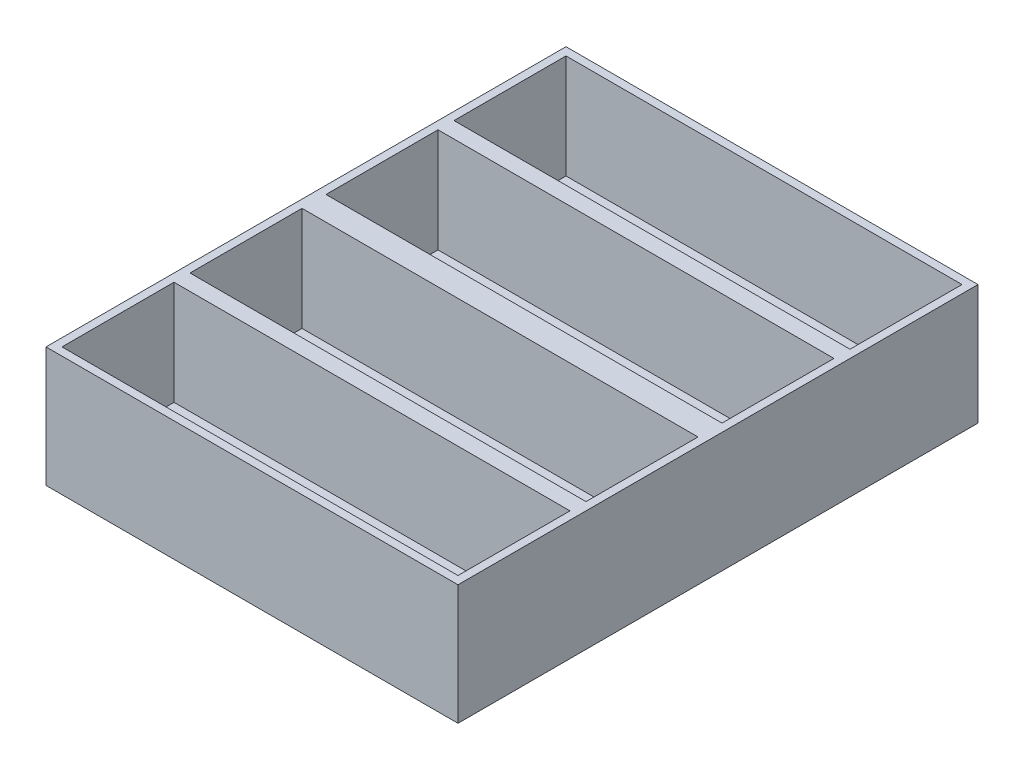
ISO-10303-21;
HEADER;
FILE_DESCRIPTION(('STEP AP214'),'2;1');
FILE_NAME('part.step','',(''),(''),'','','');
FILE_SCHEMA(('AUTOMOTIVE_DESIGN { 1 0 10303 214 1 1 1 1 }'));
ENDSEC;
DATA;
#1=APPLICATION_CONTEXT('core data for automotive mechanical design processes');
#2=APPLICATION_PROTOCOL_DEFINITION('international standard','automotive_design',2000,#1);
#3=PRODUCT_CONTEXT('',#1,'mechanical');
#4=PRODUCT('Part','Part','',(#3));
#5=PRODUCT_RELATED_PRODUCT_CATEGORY('part','',(#4));
#6=PRODUCT_DEFINITION_FORMATION('','',#4);
#7=PRODUCT_DEFINITION_CONTEXT('part definition',#1,'design');
#8=PRODUCT_DEFINITION('design','',#6,#7);
#9=PRODUCT_DEFINITION_SHAPE('','',#8);
#10=(LENGTH_UNIT() NAMED_UNIT(*) SI_UNIT(.MILLI.,.METRE.));
#11=(NAMED_UNIT(*) PLANE_ANGLE_UNIT() SI_UNIT($,.RADIAN.));
#12=(NAMED_UNIT(*) SI_UNIT($,.STERADIAN.) SOLID_ANGLE_UNIT());
#13=UNCERTAINTY_MEASURE_WITH_UNIT(LENGTH_MEASURE(1.E-05),#10,'distance_accuracy_value','');
#14=(GEOMETRIC_REPRESENTATION_CONTEXT(3) GLOBAL_UNCERTAINTY_ASSIGNED_CONTEXT((#13)) GLOBAL_UNIT_ASSIGNED_CONTEXT((#10,
#11,#12)) REPRESENTATION_CONTEXT('',''));
#15=CARTESIAN_POINT('',(0.,0.,0.));
#16=DIRECTION('',(0.,0.,1.));
#17=DIRECTION('',(1.,0.,0.));
#18=AXIS2_PLACEMENT_3D('',#15,#16,#17);
#19=CARTESIAN_POINT('',(7.5,15.,-22.));
#20=DIRECTION('',(0.,-1.,0.));
#21=DIRECTION('',(0.,0.,-1.));
#22=AXIS2_PLACEMENT_3D('',#19,#20,#21);
#23=CYLINDRICAL_SURFACE('',#22,1.5025);
#24=CARTESIAN_POINT('',(7.5,0.,-22.));
#25=DIRECTION('',(0.,1.,0.));
#26=DIRECTION('',(0.,0.,1.));
#27=AXIS2_PLACEMENT_3D('',#24,#25,#26);
#28=CIRCLE('',#27,1.5025);
#29=CARTESIAN_POINT('',(7.5,0.,-20.4975));
#30=VERTEX_POINT('',#29);
#31=EDGE_CURVE('E315',#30,#30,#28,.T.);
#32=ORIENTED_EDGE('',*,*,#31,.F.);
#33=EDGE_LOOP('',(#32));
#34=FACE_BOUND('',#33,.T.);
#35=CARTESIAN_POINT('',(7.5,2.,-22.));
#36=DIRECTION('',(0.,1.,0.));
#37=DIRECTION('',(0.,0.,1.));
#38=AXIS2_PLACEMENT_3D('',#35,#36,#37);
#39=CIRCLE('',#38,1.5025);
#40=CARTESIAN_POINT('',(7.5,2.,-20.4975));
#41=VERTEX_POINT('',#40);
#42=EDGE_CURVE('E241',#41,#41,#39,.T.);
#43=ORIENTED_EDGE('',*,*,#42,.T.);
#44=EDGE_LOOP('',(#43));
#45=FACE_BOUND('',#44,.T.);
#46=ADVANCED_FACE('F34',(#34,#45),#23,.F.);
#47=CARTESIAN_POINT('',(-7.50000000000001,15.,-22.));
#48=DIRECTION('',(0.,-1.,0.));
#49=DIRECTION('',(0.,0.,-1.));
#50=AXIS2_PLACEMENT_3D('',#47,#48,#49);
#51=CYLINDRICAL_SURFACE('',#50,1.5025);
#52=CARTESIAN_POINT('',(-7.50000000000001,0.,-22.));
#53=DIRECTION('',(0.,1.,0.));
#54=DIRECTION('',(0.,0.,1.));
#55=AXIS2_PLACEMENT_3D('',#52,#53,#54);
#56=CIRCLE('',#55,1.5025);
#57=CARTESIAN_POINT('',(-7.50000000000001,0.,-20.4975));
#58=VERTEX_POINT('',#57);
#59=EDGE_CURVE('E312',#58,#58,#56,.T.);
#60=ORIENTED_EDGE('',*,*,#59,.F.);
#61=EDGE_LOOP('',(#60));
#62=FACE_BOUND('',#61,.T.);
#63=CARTESIAN_POINT('',(-7.50000000000001,2.,-22.));
#64=DIRECTION('',(0.,1.,0.));
#65=DIRECTION('',(0.,0.,1.));
#66=AXIS2_PLACEMENT_3D('',#63,#64,#65);
#67=CIRCLE('',#66,1.5025);
#68=CARTESIAN_POINT('',(-7.50000000000001,2.,-20.4975));
#69=VERTEX_POINT('',#68);
#70=EDGE_CURVE('E38',#69,#69,#67,.T.);
#71=ORIENTED_EDGE('',*,*,#70,.T.);
#72=EDGE_LOOP('',(#71));
#73=FACE_BOUND('',#72,.T.);
#74=ADVANCED_FACE('F412',(#62,#73),#51,.F.);
#75=CARTESIAN_POINT('',(-7.5,15.,13.));
#76=DIRECTION('',(0.,-1.,0.));
#77=DIRECTION('',(0.,0.,-1.));
#78=AXIS2_PLACEMENT_3D('',#75,#76,#77);
#79=CYLINDRICAL_SURFACE('',#78,1.5025);
#80=CARTESIAN_POINT('',(-7.5,0.,13.));
#81=DIRECTION('',(0.,1.,0.));
#82=DIRECTION('',(0.,0.,1.));
#83=AXIS2_PLACEMENT_3D('',#80,#81,#82);
#84=CIRCLE('',#83,1.5025);
#85=CARTESIAN_POINT('',(-7.5,0.,14.5025));
#86=VERTEX_POINT('',#85);
#87=EDGE_CURVE('E321',#86,#86,#84,.T.);
#88=ORIENTED_EDGE('',*,*,#87,.F.);
#89=EDGE_LOOP('',(#88));
#90=FACE_BOUND('',#89,.T.);
#91=CARTESIAN_POINT('',(-7.5,2.,13.));
#92=DIRECTION('',(0.,1.,0.));
#93=DIRECTION('',(0.,0.,1.));
#94=AXIS2_PLACEMENT_3D('',#91,#92,#93);
#95=CIRCLE('',#94,1.5025);
#96=CARTESIAN_POINT('',(-7.5,2.,14.5025));
#97=VERTEX_POINT('',#96);
#98=EDGE_CURVE('E309',#97,#97,#95,.T.);
#99=ORIENTED_EDGE('',*,*,#98,.T.);
#100=EDGE_LOOP('',(#99));
#101=FACE_BOUND('',#100,.T.);
#102=ADVANCED_FACE('F415',(#90,#101),#79,.F.);
#103=CARTESIAN_POINT('',(7.5,15.,13.));
#104=DIRECTION('',(0.,-1.,0.));
#105=DIRECTION('',(0.,0.,-1.));
#106=AXIS2_PLACEMENT_3D('',#103,#104,#105);
#107=CYLINDRICAL_SURFACE('',#106,1.5025);
#108=CARTESIAN_POINT('',(7.5,0.,13.));
#109=DIRECTION('',(0.,1.,0.));
#110=DIRECTION('',(0.,0.,1.));
#111=AXIS2_PLACEMENT_3D('',#108,#109,#110);
#112=CIRCLE('',#111,1.5025);
#113=CARTESIAN_POINT('',(7.5,0.,14.5025));
#114=VERTEX_POINT('',#113);
#115=EDGE_CURVE('E318',#114,#114,#112,.T.);
#116=ORIENTED_EDGE('',*,*,#115,.F.);
#117=EDGE_LOOP('',(#116));
#118=FACE_BOUND('',#117,.T.);
#119=CARTESIAN_POINT('',(7.5,2.,13.));
#120=DIRECTION('',(0.,1.,0.));
#121=DIRECTION('',(0.,0.,1.));
#122=AXIS2_PLACEMENT_3D('',#119,#120,#121);
#123=CIRCLE('',#122,1.5025);
#124=CARTESIAN_POINT('',(7.5,2.,14.5025));
#125=VERTEX_POINT('',#124);
#126=EDGE_CURVE('E302',#125,#125,#123,.T.);
#127=ORIENTED_EDGE('',*,*,#126,.T.);
#128=EDGE_LOOP('',(#127));
#129=FACE_BOUND('',#128,.T.);
#130=ADVANCED_FACE('F352',(#118,#129),#107,.F.);
#131=CARTESIAN_POINT('',(0.,15.,0.));
#132=DIRECTION('',(0.,1.,0.));
#133=DIRECTION('',(0.,0.,1.));
#134=AXIS2_PLACEMENT_3D('',#131,#132,#133);
#135=PLANE('',#134);
#136=DIRECTION('',(0.,0.,1.));
#137=VECTOR('',#136,1.);
#138=CARTESIAN_POINT('',(-24.75,15.,-1.5));
#139=LINE('',#138,#137);
#140=CARTESIAN_POINT('',(-24.75,15.,-15.5));
#141=VERTEX_POINT('',#140);
#142=CARTESIAN_POINT('',(-24.75,15.,-1.5));
#143=VERTEX_POINT('',#142);
#144=EDGE_CURVE('E51',#141,#143,#139,.T.);
#145=ORIENTED_EDGE('',*,*,#144,.F.);
#146=DIRECTION('',(-1.,0.,0.));
#147=VECTOR('',#146,1.);
#148=CARTESIAN_POINT('',(-24.75,15.,-15.5));
#149=LINE('',#148,#147);
#150=CARTESIAN_POINT('',(24.75,15.,-15.5));
#151=VERTEX_POINT('',#150);
#152=EDGE_CURVE('E193',#151,#141,#149,.T.);
#153=ORIENTED_EDGE('',*,*,#152,.F.);
#154=DIRECTION('',(0.,0.,-1.));
#155=VECTOR('',#154,1.);
#156=CARTESIAN_POINT('',(24.75,15.,-1.5));
#157=LINE('',#156,#155);
#158=CARTESIAN_POINT('',(24.75,15.,-1.5));
#159=VERTEX_POINT('',#158);
#160=EDGE_CURVE('E196',#159,#151,#157,.T.);
#161=ORIENTED_EDGE('',*,*,#160,.F.);
#162=DIRECTION('',(1.,0.,0.));
#163=VECTOR('',#162,1.);
#164=CARTESIAN_POINT('',(-24.75,15.,-1.5));
#165=LINE('',#164,#163);
#166=EDGE_CURVE('E202',#143,#159,#165,.T.);
#167=ORIENTED_EDGE('',*,*,#166,.F.);
#168=EDGE_LOOP('',(#145,#153,#161,#167));
#169=FACE_BOUND('',#168,.T.);
#170=DIRECTION('',(1.,0.,0.));
#171=VECTOR('',#170,1.);
#172=CARTESIAN_POINT('',(-24.75,15.,-17.5));
#173=LINE('',#172,#171);
#174=CARTESIAN_POINT('',(-24.75,15.,-17.5));
#175=VERTEX_POINT('',#174);
#176=CARTESIAN_POINT('',(24.75,15.,-17.5));
#177=VERTEX_POINT('',#176);
#178=EDGE_CURVE('E59',#175,#177,#173,.T.);
#179=ORIENTED_EDGE('',*,*,#178,.F.);
#180=DIRECTION('',(0.,0.,1.));
#181=VECTOR('',#180,1.);
#182=CARTESIAN_POINT('',(-24.75,15.,-17.5));
#183=LINE('',#182,#181);
#184=CARTESIAN_POINT('',(-24.75,15.,-31.5));
#185=VERTEX_POINT('',#184);
#186=EDGE_CURVE('E215',#185,#175,#183,.T.);
#187=ORIENTED_EDGE('',*,*,#186,.F.);
#188=DIRECTION('',(-1.,0.,0.));
#189=VECTOR('',#188,1.);
#190=CARTESIAN_POINT('',(-24.75,15.,-31.5));
#191=LINE('',#190,#189);
#192=CARTESIAN_POINT('',(24.75,15.,-31.5));
#193=VERTEX_POINT('',#192);
#194=EDGE_CURVE('E229',#193,#185,#191,.T.);
#195=ORIENTED_EDGE('',*,*,#194,.F.);
#196=DIRECTION('',(0.,0.,-1.));
#197=VECTOR('',#196,1.);
#198=CARTESIAN_POINT('',(24.75,15.,-17.5));
#199=LINE('',#198,#197);
#200=EDGE_CURVE('E226',#177,#193,#199,.T.);
#201=ORIENTED_EDGE('',*,*,#200,.F.);
#202=EDGE_LOOP('',(#179,#187,#195,#201));
#203=FACE_BOUND('',#202,.T.);
#204=DIRECTION('',(0.,0.,-1.));
#205=VECTOR('',#204,1.);
#206=CARTESIAN_POINT('',(24.75,15.,17.5));
#207=LINE('',#206,#205);
#208=CARTESIAN_POINT('',(24.75,15.,31.5));
#209=VERTEX_POINT('',#208);
#210=CARTESIAN_POINT('',(24.75,15.,17.5));
#211=VERTEX_POINT('',#210);
#212=EDGE_CURVE('E244',#209,#211,#207,.T.);
#213=ORIENTED_EDGE('',*,*,#212,.F.);
#214=DIRECTION('',(1.,0.,0.));
#215=VECTOR('',#214,1.);
#216=CARTESIAN_POINT('',(-24.75,15.,31.5));
#217=LINE('',#216,#215);
#218=CARTESIAN_POINT('',(-24.75,15.,31.5));
#219=VERTEX_POINT('',#218);
#220=EDGE_CURVE('E249',#219,#209,#217,.T.);
#221=ORIENTED_EDGE('',*,*,#220,.F.);
#222=DIRECTION('',(0.,0.,1.));
#223=VECTOR('',#222,1.);
#224=CARTESIAN_POINT('',(-24.75,15.,17.5));
#225=LINE('',#224,#223);
#226=CARTESIAN_POINT('',(-24.75,15.,17.5));
#227=VERTEX_POINT('',#226);
#228=EDGE_CURVE('E263',#227,#219,#225,.T.);
#229=ORIENTED_EDGE('',*,*,#228,.F.);
#230=DIRECTION('',(-1.,0.,0.));
#231=VECTOR('',#230,1.);
#232=CARTESIAN_POINT('',(-24.75,15.,17.5));
#233=LINE('',#232,#231);
#234=EDGE_CURVE('E260',#211,#227,#233,.T.);
#235=ORIENTED_EDGE('',*,*,#234,.F.);
#236=EDGE_LOOP('',(#213,#221,#229,#235));
#237=FACE_BOUND('',#236,.T.);
#238=DIRECTION('',(0.,0.,1.));
#239=VECTOR('',#238,1.);
#240=CARTESIAN_POINT('',(-24.75,15.,1.5));
#241=LINE('',#240,#239);
#242=CARTESIAN_POINT('',(-24.75,15.,1.5));
#243=VERTEX_POINT('',#242);
#244=CARTESIAN_POINT('',(-24.75,15.,15.5));
#245=VERTEX_POINT('',#244);
#246=EDGE_CURVE('E270',#243,#245,#241,.T.);
#247=ORIENTED_EDGE('',*,*,#246,.F.);
#248=DIRECTION('',(-1.,0.,0.));
#249=VECTOR('',#248,1.);
#250=CARTESIAN_POINT('',(-24.75,15.,1.5));
#251=LINE('',#250,#249);
#252=CARTESIAN_POINT('',(24.75,15.,1.5));
#253=VERTEX_POINT('',#252);
#254=EDGE_CURVE('E281',#253,#243,#251,.T.);
#255=ORIENTED_EDGE('',*,*,#254,.F.);
#256=DIRECTION('',(0.,0.,-1.));
#257=VECTOR('',#256,1.);
#258=CARTESIAN_POINT('',(24.75,15.,1.5));
#259=LINE('',#258,#257);
#260=CARTESIAN_POINT('',(24.75,15.,15.5));
#261=VERTEX_POINT('',#260);
#262=EDGE_CURVE('E295',#261,#253,#259,.T.);
#263=ORIENTED_EDGE('',*,*,#262,.F.);
#264=DIRECTION('',(1.,0.,0.));
#265=VECTOR('',#264,1.);
#266=CARTESIAN_POINT('',(-24.75,15.,15.5));
#267=LINE('',#266,#265);
#268=EDGE_CURVE('E292',#245,#261,#267,.T.);
#269=ORIENTED_EDGE('',*,*,#268,.F.);
#270=EDGE_LOOP('',(#247,#255,#263,#269));
#271=FACE_BOUND('',#270,.T.);
#272=DIRECTION('',(0.,0.,1.));
#273=VECTOR('',#272,1.);
#274=CARTESIAN_POINT('',(-25.75,15.,-32.5));
#275=LINE('',#274,#273);
#276=CARTESIAN_POINT('',(-25.75,15.,-32.5));
#277=VERTEX_POINT('',#276);
#278=CARTESIAN_POINT('',(-25.75,15.,32.5));
#279=VERTEX_POINT('',#278);
#280=EDGE_CURVE('E325',#277,#279,#275,.T.);
#281=ORIENTED_EDGE('',*,*,#280,.T.);
#282=DIRECTION('',(1.,0.,0.));
#283=VECTOR('',#282,1.);
#284=CARTESIAN_POINT('',(-25.75,15.,32.5));
#285=LINE('',#284,#283);
#286=CARTESIAN_POINT('',(25.75,15.,32.5));
#287=VERTEX_POINT('',#286);
#288=EDGE_CURVE('E328',#279,#287,#285,.T.);
#289=ORIENTED_EDGE('',*,*,#288,.T.);
#290=DIRECTION('',(0.,0.,-1.));
#291=VECTOR('',#290,1.);
#292=CARTESIAN_POINT('',(25.75,15.,-32.5));
#293=LINE('',#292,#291);
#294=CARTESIAN_POINT('',(25.75,15.,-32.5));
#295=VERTEX_POINT('',#294);
#296=EDGE_CURVE('E331',#287,#295,#293,.T.);
#297=ORIENTED_EDGE('',*,*,#296,.T.);
#298=DIRECTION('',(-1.,0.,0.));
#299=VECTOR('',#298,1.);
#300=CARTESIAN_POINT('',(-25.75,15.,-32.5));
#301=LINE('',#300,#299);
#302=EDGE_CURVE('E333',#295,#277,#301,.T.);
#303=ORIENTED_EDGE('',*,*,#302,.T.);
#304=EDGE_LOOP('',(#281,#289,#297,#303));
#305=FACE_BOUND('',#304,.T.);
#306=ADVANCED_FACE('F377',(#169,#203,#237,#271,#305),#135,.T.);
#307=CARTESIAN_POINT('',(0.,0.,0.));
#308=DIRECTION('',(0.,1.,0.));
#309=DIRECTION('',(0.,0.,1.));
#310=AXIS2_PLACEMENT_3D('',#307,#308,#309);
#311=PLANE('',#310);
#312=DIRECTION('',(0.,0.,1.));
#313=VECTOR('',#312,1.);
#314=CARTESIAN_POINT('',(-25.75,0.,-32.5));
#315=LINE('',#314,#313);
#316=CARTESIAN_POINT('',(-25.75,0.,-32.5));
#317=VERTEX_POINT('',#316);
#318=CARTESIAN_POINT('',(-25.75,0.,32.5));
#319=VERTEX_POINT('',#318);
#320=EDGE_CURVE('E324',#317,#319,#315,.T.);
#321=ORIENTED_EDGE('',*,*,#320,.F.);
#322=DIRECTION('',(-1.,0.,0.));
#323=VECTOR('',#322,1.);
#324=CARTESIAN_POINT('',(-25.75,0.,-32.5));
#325=LINE('',#324,#323);
#326=CARTESIAN_POINT('',(25.75,0.,-32.5));
#327=VERTEX_POINT('',#326);
#328=EDGE_CURVE('E329',#327,#317,#325,.T.);
#329=ORIENTED_EDGE('',*,*,#328,.F.);
#330=DIRECTION('',(0.,0.,-1.));
#331=VECTOR('',#330,1.);
#332=CARTESIAN_POINT('',(25.75,0.,-32.5));
#333=LINE('',#332,#331);
#334=CARTESIAN_POINT('',(25.75,0.,32.5));
#335=VERTEX_POINT('',#334);
#336=EDGE_CURVE('E340',#335,#327,#333,.T.);
#337=ORIENTED_EDGE('',*,*,#336,.F.);
#338=DIRECTION('',(1.,0.,0.));
#339=VECTOR('',#338,1.);
#340=CARTESIAN_POINT('',(-25.75,0.,32.5));
#341=LINE('',#340,#339);
#342=EDGE_CURVE('E338',#319,#335,#341,.T.);
#343=ORIENTED_EDGE('',*,*,#342,.F.);
#344=EDGE_LOOP('',(#321,#329,#337,#343));
#345=FACE_BOUND('',#344,.T.);
#346=ORIENTED_EDGE('',*,*,#87,.T.);
#347=EDGE_LOOP('',(#346));
#348=FACE_BOUND('',#347,.T.);
#349=ORIENTED_EDGE('',*,*,#115,.T.);
#350=EDGE_LOOP('',(#349));
#351=FACE_BOUND('',#350,.T.);
#352=ORIENTED_EDGE('',*,*,#31,.T.);
#353=EDGE_LOOP('',(#352));
#354=FACE_BOUND('',#353,.T.);
#355=ORIENTED_EDGE('',*,*,#59,.T.);
#356=EDGE_LOOP('',(#355));
#357=FACE_BOUND('',#356,.T.);
#358=ADVANCED_FACE('F380',(#345,#348,#351,#354,#357),#311,.F.);
#359=CARTESIAN_POINT('',(-25.75,15.,-32.5));
#360=DIRECTION('',(1.,0.,0.));
#361=DIRECTION('',(0.,0.,-1.));
#362=AXIS2_PLACEMENT_3D('',#359,#360,#361);
#363=PLANE('',#362);
#364=ORIENTED_EDGE('',*,*,#320,.T.);
#365=DIRECTION('',(0.,-1.,0.));
#366=VECTOR('',#365,1.);
#367=CARTESIAN_POINT('',(-25.75,15.,32.5));
#368=LINE('',#367,#366);
#369=EDGE_CURVE('E11',#279,#319,#368,.T.);
#370=ORIENTED_EDGE('',*,*,#369,.F.);
#371=ORIENTED_EDGE('',*,*,#280,.F.);
#372=DIRECTION('',(0.,-1.,0.));
#373=VECTOR('',#372,1.);
#374=CARTESIAN_POINT('',(-25.75,15.,-32.5));
#375=LINE('',#374,#373);
#376=EDGE_CURVE('E335',#277,#317,#375,.T.);
#377=ORIENTED_EDGE('',*,*,#376,.T.);
#378=EDGE_LOOP('',(#364,#370,#371,#377));
#379=FACE_BOUND('',#378,.T.);
#380=ADVANCED_FACE('F36',(#379),#363,.F.);
#381=CARTESIAN_POINT('',(-25.75,15.,32.5));
#382=DIRECTION('',(0.,0.,-1.));
#383=DIRECTION('',(-1.,0.,0.));
#384=AXIS2_PLACEMENT_3D('',#381,#382,#383);
#385=PLANE('',#384);
#386=ORIENTED_EDGE('',*,*,#342,.T.);
#387=DIRECTION('',(0.,-1.,0.));
#388=VECTOR('',#387,1.);
#389=CARTESIAN_POINT('',(25.75,15.,32.5));
#390=LINE('',#389,#388);
#391=EDGE_CURVE('E43',#287,#335,#390,.T.);
#392=ORIENTED_EDGE('',*,*,#391,.F.);
#393=ORIENTED_EDGE('',*,*,#288,.F.);
#394=ORIENTED_EDGE('',*,*,#369,.T.);
#395=EDGE_LOOP('',(#386,#392,#393,#394));
#396=FACE_BOUND('',#395,.T.);
#397=ADVANCED_FACE('F391',(#396),#385,.F.);
#398=CARTESIAN_POINT('',(25.75,15.,-32.5));
#399=DIRECTION('',(-1.,0.,0.));
#400=DIRECTION('',(0.,0.,1.));
#401=AXIS2_PLACEMENT_3D('',#398,#399,#400);
#402=PLANE('',#401);
#403=ORIENTED_EDGE('',*,*,#336,.T.);
#404=DIRECTION('',(0.,-1.,0.));
#405=VECTOR('',#404,1.);
#406=CARTESIAN_POINT('',(25.75,15.,-32.5));
#407=LINE('',#406,#405);
#408=EDGE_CURVE('E345',#295,#327,#407,.T.);
#409=ORIENTED_EDGE('',*,*,#408,.F.);
#410=ORIENTED_EDGE('',*,*,#296,.F.);
#411=ORIENTED_EDGE('',*,*,#391,.T.);
#412=EDGE_LOOP('',(#403,#409,#410,#411));
#413=FACE_BOUND('',#412,.T.);
#414=ADVANCED_FACE('F396',(#413),#402,.F.);
#415=CARTESIAN_POINT('',(-25.75,15.,-32.5));
#416=DIRECTION('',(0.,0.,1.));
#417=DIRECTION('',(1.,0.,0.));
#418=AXIS2_PLACEMENT_3D('',#415,#416,#417);
#419=PLANE('',#418);
#420=ORIENTED_EDGE('',*,*,#328,.T.);
#421=ORIENTED_EDGE('',*,*,#376,.F.);
#422=ORIENTED_EDGE('',*,*,#302,.F.);
#423=ORIENTED_EDGE('',*,*,#408,.T.);
#424=EDGE_LOOP('',(#420,#421,#422,#423));
#425=FACE_BOUND('',#424,.T.);
#426=ADVANCED_FACE('F399',(#425),#419,.F.);
#427=CARTESIAN_POINT('',(-24.75,2.,1.5));
#428=DIRECTION('',(-1.,0.,0.));
#429=DIRECTION('',(0.,0.,1.));
#430=AXIS2_PLACEMENT_3D('',#427,#428,#429);
#431=PLANE('',#430);
#432=ORIENTED_EDGE('',*,*,#246,.T.);
#433=DIRECTION('',(0.,1.,0.));
#434=VECTOR('',#433,1.);
#435=CARTESIAN_POINT('',(-24.75,2.,15.5));
#436=LINE('',#435,#434);
#437=CARTESIAN_POINT('',(-24.75,2.,15.5));
#438=VERTEX_POINT('',#437);
#439=EDGE_CURVE('E290',#438,#245,#436,.T.);
#440=ORIENTED_EDGE('',*,*,#439,.F.);
#441=DIRECTION('',(0.,0.,1.));
#442=VECTOR('',#441,1.);
#443=CARTESIAN_POINT('',(-24.75,2.,1.5));
#444=LINE('',#443,#442);
#445=CARTESIAN_POINT('',(-24.75,2.,1.5));
#446=VERTEX_POINT('',#445);
#447=EDGE_CURVE('E277',#446,#438,#444,.T.);
#448=ORIENTED_EDGE('',*,*,#447,.F.);
#449=DIRECTION('',(0.,1.,0.));
#450=VECTOR('',#449,1.);
#451=CARTESIAN_POINT('',(-24.75,2.,1.5));
#452=LINE('',#451,#450);
#453=EDGE_CURVE('E300',#446,#243,#452,.T.);
#454=ORIENTED_EDGE('',*,*,#453,.T.);
#455=EDGE_LOOP('',(#432,#440,#448,#454));
#456=FACE_BOUND('',#455,.T.);
#457=ADVANCED_FACE('F365',(#456),#431,.F.);
#458=CARTESIAN_POINT('',(-24.75,2.,1.5));
#459=DIRECTION('',(0.,0.,-1.));
#460=DIRECTION('',(-1.,0.,0.));
#461=AXIS2_PLACEMENT_3D('',#458,#459,#460);
#462=PLANE('',#461);
#463=ORIENTED_EDGE('',*,*,#254,.T.);
#464=ORIENTED_EDGE('',*,*,#453,.F.);
#465=DIRECTION('',(-1.,0.,0.));
#466=VECTOR('',#465,1.);
#467=CARTESIAN_POINT('',(-24.75,2.,1.5));
#468=LINE('',#467,#466);
#469=CARTESIAN_POINT('',(24.75,2.,1.5));
#470=VERTEX_POINT('',#469);
#471=EDGE_CURVE('E287',#470,#446,#468,.T.);
#472=ORIENTED_EDGE('',*,*,#471,.F.);
#473=DIRECTION('',(0.,1.,0.));
#474=VECTOR('',#473,1.);
#475=CARTESIAN_POINT('',(24.75,2.,1.5));
#476=LINE('',#475,#474);
#477=EDGE_CURVE('E303',#470,#253,#476,.T.);
#478=ORIENTED_EDGE('',*,*,#477,.T.);
#479=EDGE_LOOP('',(#463,#464,#472,#478));
#480=FACE_BOUND('',#479,.T.);
#481=ADVANCED_FACE('F374',(#480),#462,.F.);
#482=CARTESIAN_POINT('',(24.75,2.,1.5));
#483=DIRECTION('',(1.,0.,0.));
#484=DIRECTION('',(0.,0.,-1.));
#485=AXIS2_PLACEMENT_3D('',#482,#483,#484);
#486=PLANE('',#485);
#487=ORIENTED_EDGE('',*,*,#262,.T.);
#488=ORIENTED_EDGE('',*,*,#477,.F.);
#489=DIRECTION('',(0.,0.,-1.));
#490=VECTOR('',#489,1.);
#491=CARTESIAN_POINT('',(24.75,2.,1.5));
#492=LINE('',#491,#490);
#493=CARTESIAN_POINT('',(24.75,2.,15.5));
#494=VERTEX_POINT('',#493);
#495=EDGE_CURVE('E284',#494,#470,#492,.T.);
#496=ORIENTED_EDGE('',*,*,#495,.F.);
#497=DIRECTION('',(0.,1.,0.));
#498=VECTOR('',#497,1.);
#499=CARTESIAN_POINT('',(24.75,2.,15.5));
#500=LINE('',#499,#498);
#501=EDGE_CURVE('E305',#494,#261,#500,.T.);
#502=ORIENTED_EDGE('',*,*,#501,.T.);
#503=EDGE_LOOP('',(#487,#488,#496,#502));
#504=FACE_BOUND('',#503,.T.);
#505=ADVANCED_FACE('F372',(#504),#486,.F.);
#506=CARTESIAN_POINT('',(-24.75,2.,15.5));
#507=DIRECTION('',(0.,0.,1.));
#508=DIRECTION('',(1.,0.,0.));
#509=AXIS2_PLACEMENT_3D('',#506,#507,#508);
#510=PLANE('',#509);
#511=ORIENTED_EDGE('',*,*,#268,.T.);
#512=ORIENTED_EDGE('',*,*,#501,.F.);
#513=DIRECTION('',(1.,0.,0.));
#514=VECTOR('',#513,1.);
#515=CARTESIAN_POINT('',(-24.75,2.,15.5));
#516=LINE('',#515,#514);
#517=EDGE_CURVE('E280',#438,#494,#516,.T.);
#518=ORIENTED_EDGE('',*,*,#517,.F.);
#519=ORIENTED_EDGE('',*,*,#439,.T.);
#520=EDGE_LOOP('',(#511,#512,#518,#519));
#521=FACE_BOUND('',#520,.T.);
#522=ADVANCED_FACE('F358',(#521),#510,.F.);
#523=CARTESIAN_POINT('',(0.,2.,0.));
#524=DIRECTION('',(0.,1.,0.));
#525=DIRECTION('',(0.,0.,1.));
#526=AXIS2_PLACEMENT_3D('',#523,#524,#525);
#527=PLANE('',#526);
#528=ORIENTED_EDGE('',*,*,#98,.F.);
#529=EDGE_LOOP('',(#528));
#530=FACE_BOUND('',#529,.T.);
#531=ORIENTED_EDGE('',*,*,#126,.F.);
#532=EDGE_LOOP('',(#531));
#533=FACE_BOUND('',#532,.T.);
#534=ORIENTED_EDGE('',*,*,#447,.T.);
#535=ORIENTED_EDGE('',*,*,#517,.T.);
#536=ORIENTED_EDGE('',*,*,#495,.T.);
#537=ORIENTED_EDGE('',*,*,#471,.T.);
#538=EDGE_LOOP('',(#534,#535,#536,#537));
#539=FACE_BOUND('',#538,.T.);
#540=ADVANCED_FACE('F354',(#530,#533,#539),#527,.T.);
#541=CARTESIAN_POINT('',(24.75,2.,17.5));
#542=DIRECTION('',(1.,0.,0.));
#543=DIRECTION('',(0.,0.,-1.));
#544=AXIS2_PLACEMENT_3D('',#541,#542,#543);
#545=PLANE('',#544);
#546=ORIENTED_EDGE('',*,*,#212,.T.);
#547=DIRECTION('',(0.,1.,0.));
#548=VECTOR('',#547,1.);
#549=CARTESIAN_POINT('',(24.75,2.,17.5));
#550=LINE('',#549,#548);
#551=CARTESIAN_POINT('',(24.75,2.,17.5));
#552=VERTEX_POINT('',#551);
#553=EDGE_CURVE('E258',#552,#211,#550,.T.);
#554=ORIENTED_EDGE('',*,*,#553,.F.);
#555=DIRECTION('',(0.,0.,-1.));
#556=VECTOR('',#555,1.);
#557=CARTESIAN_POINT('',(24.75,2.,17.5));
#558=LINE('',#557,#556);
#559=CARTESIAN_POINT('',(24.75,2.,31.5));
#560=VERTEX_POINT('',#559);
#561=EDGE_CURVE('E245',#560,#552,#558,.T.);
#562=ORIENTED_EDGE('',*,*,#561,.F.);
#563=DIRECTION('',(0.,1.,0.));
#564=VECTOR('',#563,1.);
#565=CARTESIAN_POINT('',(24.75,2.,31.5));
#566=LINE('',#565,#564);
#567=EDGE_CURVE('E268',#560,#209,#566,.T.);
#568=ORIENTED_EDGE('',*,*,#567,.T.);
#569=EDGE_LOOP('',(#546,#554,#562,#568));
#570=FACE_BOUND('',#569,.T.);
#571=ADVANCED_FACE('F357',(#570),#545,.F.);
#572=CARTESIAN_POINT('',(-24.75,2.,31.5));
#573=DIRECTION('',(0.,0.,1.));
#574=DIRECTION('',(1.,0.,0.));
#575=AXIS2_PLACEMENT_3D('',#572,#573,#574);
#576=PLANE('',#575);
#577=ORIENTED_EDGE('',*,*,#220,.T.);
#578=ORIENTED_EDGE('',*,*,#567,.F.);
#579=DIRECTION('',(1.,0.,0.));
#580=VECTOR('',#579,1.);
#581=CARTESIAN_POINT('',(-24.75,2.,31.5));
#582=LINE('',#581,#580);
#583=CARTESIAN_POINT('',(-24.75,2.,31.5));
#584=VERTEX_POINT('',#583);
#585=EDGE_CURVE('E255',#584,#560,#582,.T.);
#586=ORIENTED_EDGE('',*,*,#585,.F.);
#587=DIRECTION('',(0.,1.,0.));
#588=VECTOR('',#587,1.);
#589=CARTESIAN_POINT('',(-24.75,2.,31.5));
#590=LINE('',#589,#588);
#591=EDGE_CURVE('E271',#584,#219,#590,.T.);
#592=ORIENTED_EDGE('',*,*,#591,.T.);
#593=EDGE_LOOP('',(#577,#578,#586,#592));
#594=FACE_BOUND('',#593,.T.);
#595=ADVANCED_FACE('F455',(#594),#576,.F.);
#596=CARTESIAN_POINT('',(-24.75,2.,17.5));
#597=DIRECTION('',(-1.,0.,0.));
#598=DIRECTION('',(0.,0.,1.));
#599=AXIS2_PLACEMENT_3D('',#596,#597,#598);
#600=PLANE('',#599);
#601=ORIENTED_EDGE('',*,*,#228,.T.);
#602=ORIENTED_EDGE('',*,*,#591,.F.);
#603=DIRECTION('',(0.,0.,1.));
#604=VECTOR('',#603,1.);
#605=CARTESIAN_POINT('',(-24.75,2.,17.5));
#606=LINE('',#605,#604);
#607=CARTESIAN_POINT('',(-24.75,2.,17.5));
#608=VERTEX_POINT('',#607);
#609=EDGE_CURVE('E252',#608,#584,#606,.T.);
#610=ORIENTED_EDGE('',*,*,#609,.F.);
#611=DIRECTION('',(0.,1.,0.));
#612=VECTOR('',#611,1.);
#613=CARTESIAN_POINT('',(-24.75,2.,17.5));
#614=LINE('',#613,#612);
#615=EDGE_CURVE('E273',#608,#227,#614,.T.);
#616=ORIENTED_EDGE('',*,*,#615,.T.);
#617=EDGE_LOOP('',(#601,#602,#610,#616));
#618=FACE_BOUND('',#617,.T.);
#619=ADVANCED_FACE('F457',(#618),#600,.F.);
#620=CARTESIAN_POINT('',(-24.75,2.,17.5));
#621=DIRECTION('',(0.,0.,-1.));
#622=DIRECTION('',(-1.,0.,0.));
#623=AXIS2_PLACEMENT_3D('',#620,#621,#622);
#624=PLANE('',#623);
#625=ORIENTED_EDGE('',*,*,#234,.T.);
#626=ORIENTED_EDGE('',*,*,#615,.F.);
#627=DIRECTION('',(-1.,0.,0.));
#628=VECTOR('',#627,1.);
#629=CARTESIAN_POINT('',(-24.75,2.,17.5));
#630=LINE('',#629,#628);
#631=EDGE_CURVE('E248',#552,#608,#630,.T.);
#632=ORIENTED_EDGE('',*,*,#631,.F.);
#633=ORIENTED_EDGE('',*,*,#553,.T.);
#634=EDGE_LOOP('',(#625,#626,#632,#633));
#635=FACE_BOUND('',#634,.T.);
#636=ADVANCED_FACE('F449',(#635),#624,.F.);
#637=CARTESIAN_POINT('',(0.,2.,0.));
#638=DIRECTION('',(0.,1.,0.));
#639=DIRECTION('',(0.,0.,1.));
#640=AXIS2_PLACEMENT_3D('',#637,#638,#639);
#641=PLANE('',#640);
#642=ORIENTED_EDGE('',*,*,#561,.T.);
#643=ORIENTED_EDGE('',*,*,#631,.T.);
#644=ORIENTED_EDGE('',*,*,#609,.T.);
#645=ORIENTED_EDGE('',*,*,#585,.T.);
#646=EDGE_LOOP('',(#642,#643,#644,#645));
#647=FACE_BOUND('',#646,.T.);
#648=ADVANCED_FACE('F452',(#647),#641,.T.);
#649=CARTESIAN_POINT('',(-24.75,2.,-17.5));
#650=DIRECTION('',(0.,0.,1.));
#651=DIRECTION('',(1.,0.,0.));
#652=AXIS2_PLACEMENT_3D('',#649,#650,#651);
#653=PLANE('',#652);
#654=ORIENTED_EDGE('',*,*,#178,.T.);
#655=DIRECTION('',(0.,1.,0.));
#656=VECTOR('',#655,1.);
#657=CARTESIAN_POINT('',(24.75,2.,-17.5));
#658=LINE('',#657,#656);
#659=CARTESIAN_POINT('',(24.75,2.,-17.5));
#660=VERTEX_POINT('',#659);
#661=EDGE_CURVE('E224',#660,#177,#658,.T.);
#662=ORIENTED_EDGE('',*,*,#661,.F.);
#663=DIRECTION('',(1.,0.,0.));
#664=VECTOR('',#663,1.);
#665=CARTESIAN_POINT('',(-24.75,2.,-17.5));
#666=LINE('',#665,#664);
#667=CARTESIAN_POINT('',(-24.75,2.,-17.5));
#668=VERTEX_POINT('',#667);
#669=EDGE_CURVE('E211',#668,#660,#666,.T.);
#670=ORIENTED_EDGE('',*,*,#669,.F.);
#671=DIRECTION('',(0.,1.,0.));
#672=VECTOR('',#671,1.);
#673=CARTESIAN_POINT('',(-24.75,2.,-17.5));
#674=LINE('',#673,#672);
#675=EDGE_CURVE('E234',#668,#175,#674,.T.);
#676=ORIENTED_EDGE('',*,*,#675,.T.);
#677=EDGE_LOOP('',(#654,#662,#670,#676));
#678=FACE_BOUND('',#677,.T.);
#679=ADVANCED_FACE('F429',(#678),#653,.F.);
#680=CARTESIAN_POINT('',(-24.75,2.,-17.5));
#681=DIRECTION('',(-1.,0.,0.));
#682=DIRECTION('',(0.,0.,1.));
#683=AXIS2_PLACEMENT_3D('',#680,#681,#682);
#684=PLANE('',#683);
#685=ORIENTED_EDGE('',*,*,#186,.T.);
#686=ORIENTED_EDGE('',*,*,#675,.F.);
#687=DIRECTION('',(0.,0.,1.));
#688=VECTOR('',#687,1.);
#689=CARTESIAN_POINT('',(-24.75,2.,-17.5));
#690=LINE('',#689,#688);
#691=CARTESIAN_POINT('',(-24.75,2.,-31.5));
#692=VERTEX_POINT('',#691);
#693=EDGE_CURVE('E221',#692,#668,#690,.T.);
#694=ORIENTED_EDGE('',*,*,#693,.F.);
#695=DIRECTION('',(0.,1.,0.));
#696=VECTOR('',#695,1.);
#697=CARTESIAN_POINT('',(-24.75,2.,-31.5));
#698=LINE('',#697,#696);
#699=EDGE_CURVE('E236',#692,#185,#698,.T.);
#700=ORIENTED_EDGE('',*,*,#699,.T.);
#701=EDGE_LOOP('',(#685,#686,#694,#700));
#702=FACE_BOUND('',#701,.T.);
#703=ADVANCED_FACE('F437',(#702),#684,.F.);
#704=CARTESIAN_POINT('',(-24.75,2.,-31.5));
#705=DIRECTION('',(0.,0.,-1.));
#706=DIRECTION('',(-1.,0.,0.));
#707=AXIS2_PLACEMENT_3D('',#704,#705,#706);
#708=PLANE('',#707);
#709=ORIENTED_EDGE('',*,*,#194,.T.);
#710=ORIENTED_EDGE('',*,*,#699,.F.);
#711=DIRECTION('',(-1.,0.,0.));
#712=VECTOR('',#711,1.);
#713=CARTESIAN_POINT('',(-24.75,2.,-31.5));
#714=LINE('',#713,#712);
#715=CARTESIAN_POINT('',(24.75,2.,-31.5));
#716=VERTEX_POINT('',#715);
#717=EDGE_CURVE('E218',#716,#692,#714,.T.);
#718=ORIENTED_EDGE('',*,*,#717,.F.);
#719=DIRECTION('',(0.,1.,0.));
#720=VECTOR('',#719,1.);
#721=CARTESIAN_POINT('',(24.75,2.,-31.5));
#722=LINE('',#721,#720);
#723=EDGE_CURVE('E238',#716,#193,#722,.T.);
#724=ORIENTED_EDGE('',*,*,#723,.T.);
#725=EDGE_LOOP('',(#709,#710,#718,#724));
#726=FACE_BOUND('',#725,.T.);
#727=ADVANCED_FACE('F435',(#726),#708,.F.);
#728=CARTESIAN_POINT('',(24.75,2.,-17.5));
#729=DIRECTION('',(1.,0.,0.));
#730=DIRECTION('',(0.,0.,-1.));
#731=AXIS2_PLACEMENT_3D('',#728,#729,#730);
#732=PLANE('',#731);
#733=ORIENTED_EDGE('',*,*,#200,.T.);
#734=ORIENTED_EDGE('',*,*,#723,.F.);
#735=DIRECTION('',(0.,0.,-1.));
#736=VECTOR('',#735,1.);
#737=CARTESIAN_POINT('',(24.75,2.,-17.5));
#738=LINE('',#737,#736);
#739=EDGE_CURVE('E214',#660,#716,#738,.T.);
#740=ORIENTED_EDGE('',*,*,#739,.F.);
#741=ORIENTED_EDGE('',*,*,#661,.T.);
#742=EDGE_LOOP('',(#733,#734,#740,#741));
#743=FACE_BOUND('',#742,.T.);
#744=ADVANCED_FACE('F423',(#743),#732,.F.);
#745=CARTESIAN_POINT('',(0.,2.,0.));
#746=DIRECTION('',(0.,1.,0.));
#747=DIRECTION('',(0.,0.,1.));
#748=AXIS2_PLACEMENT_3D('',#745,#746,#747);
#749=PLANE('',#748);
#750=ORIENTED_EDGE('',*,*,#42,.F.);
#751=EDGE_LOOP('',(#750));
#752=FACE_BOUND('',#751,.T.);
#753=ORIENTED_EDGE('',*,*,#70,.F.);
#754=EDGE_LOOP('',(#753));
#755=FACE_BOUND('',#754,.T.);
#756=ORIENTED_EDGE('',*,*,#669,.T.);
#757=ORIENTED_EDGE('',*,*,#739,.T.);
#758=ORIENTED_EDGE('',*,*,#717,.T.);
#759=ORIENTED_EDGE('',*,*,#693,.T.);
#760=EDGE_LOOP('',(#756,#757,#758,#759));
#761=FACE_BOUND('',#760,.T.);
#762=ADVANCED_FACE('F420',(#752,#755,#761),#749,.T.);
#763=CARTESIAN_POINT('',(-24.75,2.,-1.5));
#764=DIRECTION('',(-1.,0.,0.));
#765=DIRECTION('',(0.,0.,1.));
#766=AXIS2_PLACEMENT_3D('',#763,#764,#765);
#767=PLANE('',#766);
#768=ORIENTED_EDGE('',*,*,#144,.T.);
#769=DIRECTION('',(0.,1.,0.));
#770=VECTOR('',#769,1.);
#771=CARTESIAN_POINT('',(-24.75,2.,-1.5));
#772=LINE('',#771,#770);
#773=CARTESIAN_POINT('',(-24.75,2.,-1.5));
#774=VERTEX_POINT('',#773);
#775=EDGE_CURVE('E171',#774,#143,#772,.T.);
#776=ORIENTED_EDGE('',*,*,#775,.F.);
#777=DIRECTION('',(0.,0.,1.));
#778=VECTOR('',#777,1.);
#779=CARTESIAN_POINT('',(-24.75,2.,-1.5));
#780=LINE('',#779,#778);
#781=CARTESIAN_POINT('',(-24.75,2.,-15.5));
#782=VERTEX_POINT('',#781);
#783=EDGE_CURVE('E175',#782,#774,#780,.T.);
#784=ORIENTED_EDGE('',*,*,#783,.F.);
#785=DIRECTION('',(0.,1.,0.));
#786=VECTOR('',#785,1.);
#787=CARTESIAN_POINT('',(-24.75,2.,-15.5));
#788=LINE('',#787,#786);
#789=EDGE_CURVE('E206',#782,#141,#788,.T.);
#790=ORIENTED_EDGE('',*,*,#789,.T.);
#791=EDGE_LOOP('',(#768,#776,#784,#790));
#792=FACE_BOUND('',#791,.T.);
#793=ADVANCED_FACE('F173',(#792),#767,.F.);
#794=CARTESIAN_POINT('',(-24.75,2.,-15.5));
#795=DIRECTION('',(0.,0.,-1.));
#796=DIRECTION('',(-1.,0.,0.));
#797=AXIS2_PLACEMENT_3D('',#794,#795,#796);
#798=PLANE('',#797);
#799=ORIENTED_EDGE('',*,*,#152,.T.);
#800=ORIENTED_EDGE('',*,*,#789,.F.);
#801=DIRECTION('',(-1.,0.,0.));
#802=VECTOR('',#801,1.);
#803=CARTESIAN_POINT('',(-24.75,2.,-15.5));
#804=LINE('',#803,#802);
#805=CARTESIAN_POINT('',(24.75,2.,-15.5));
#806=VERTEX_POINT('',#805);
#807=EDGE_CURVE('E181',#806,#782,#804,.T.);
#808=ORIENTED_EDGE('',*,*,#807,.F.);
#809=DIRECTION('',(0.,1.,0.));
#810=VECTOR('',#809,1.);
#811=CARTESIAN_POINT('',(24.75,2.,-15.5));
#812=LINE('',#811,#810);
#813=EDGE_CURVE('E208',#806,#151,#812,.T.);
#814=ORIENTED_EDGE('',*,*,#813,.T.);
#815=EDGE_LOOP('',(#799,#800,#808,#814));
#816=FACE_BOUND('',#815,.T.);
#817=ADVANCED_FACE('F639',(#816),#798,.F.);
#818=CARTESIAN_POINT('',(24.75,2.,-1.5));
#819=DIRECTION('',(1.,0.,0.));
#820=DIRECTION('',(0.,0.,-1.));
#821=AXIS2_PLACEMENT_3D('',#818,#819,#820);
#822=PLANE('',#821);
#823=ORIENTED_EDGE('',*,*,#160,.T.);
#824=ORIENTED_EDGE('',*,*,#813,.F.);
#825=DIRECTION('',(0.,0.,-1.));
#826=VECTOR('',#825,1.);
#827=CARTESIAN_POINT('',(24.75,2.,-1.5));
#828=LINE('',#827,#826);
#829=CARTESIAN_POINT('',(24.75,2.,-1.5));
#830=VERTEX_POINT('',#829);
#831=EDGE_CURVE('E189',#830,#806,#828,.T.);
#832=ORIENTED_EDGE('',*,*,#831,.F.);
#833=DIRECTION('',(0.,1.,0.));
#834=VECTOR('',#833,1.);
#835=CARTESIAN_POINT('',(24.75,2.,-1.5));
#836=LINE('',#835,#834);
#837=EDGE_CURVE('E180',#830,#159,#836,.T.);
#838=ORIENTED_EDGE('',*,*,#837,.T.);
#839=EDGE_LOOP('',(#823,#824,#832,#838));
#840=FACE_BOUND('',#839,.T.);
#841=ADVANCED_FACE('F648',(#840),#822,.F.);
#842=CARTESIAN_POINT('',(-24.75,2.,-1.5));
#843=DIRECTION('',(0.,0.,1.));
#844=DIRECTION('',(1.,0.,0.));
#845=AXIS2_PLACEMENT_3D('',#842,#843,#844);
#846=PLANE('',#845);
#847=ORIENTED_EDGE('',*,*,#166,.T.);
#848=ORIENTED_EDGE('',*,*,#837,.F.);
#849=DIRECTION('',(1.,0.,0.));
#850=VECTOR('',#849,1.);
#851=CARTESIAN_POINT('',(-24.75,2.,-1.5));
#852=LINE('',#851,#850);
#853=EDGE_CURVE('E184',#774,#830,#852,.T.);
#854=ORIENTED_EDGE('',*,*,#853,.F.);
#855=ORIENTED_EDGE('',*,*,#775,.T.);
#856=EDGE_LOOP('',(#847,#848,#854,#855));
#857=FACE_BOUND('',#856,.T.);
#858=ADVANCED_FACE('F185',(#857),#846,.F.);
#859=CARTESIAN_POINT('',(0.,2.,0.));
#860=DIRECTION('',(0.,-1.,0.));
#861=DIRECTION('',(0.,0.,-1.));
#862=AXIS2_PLACEMENT_3D('',#859,#860,#861);
#863=PLANE('',#862);
#864=ORIENTED_EDGE('',*,*,#783,.T.);
#865=ORIENTED_EDGE('',*,*,#853,.T.);
#866=ORIENTED_EDGE('',*,*,#831,.T.);
#867=ORIENTED_EDGE('',*,*,#807,.T.);
#868=EDGE_LOOP('',(#864,#865,#866,#867));
#869=FACE_BOUND('',#868,.T.);
#870=ADVANCED_FACE('F191',(#869),#863,.F.);
#871=CLOSED_SHELL('',(#46,#74,#102,#130,#306,#358,#380,#397,#414,#426,#457,#481,#505,#522,#540,
#571,#595,#619,#636,#648,#679,#703,#727,#744,#762,#793,#817,#841,#858,#870));
#872=MANIFOLD_SOLID_BREP('B2',#871);
#873=ADVANCED_BREP_SHAPE_REPRESENTATION('',(#18,#872),#14);
#874=SHAPE_DEFINITION_REPRESENTATION(#9,#873);
ENDSEC;
END-ISO-10303-21;
